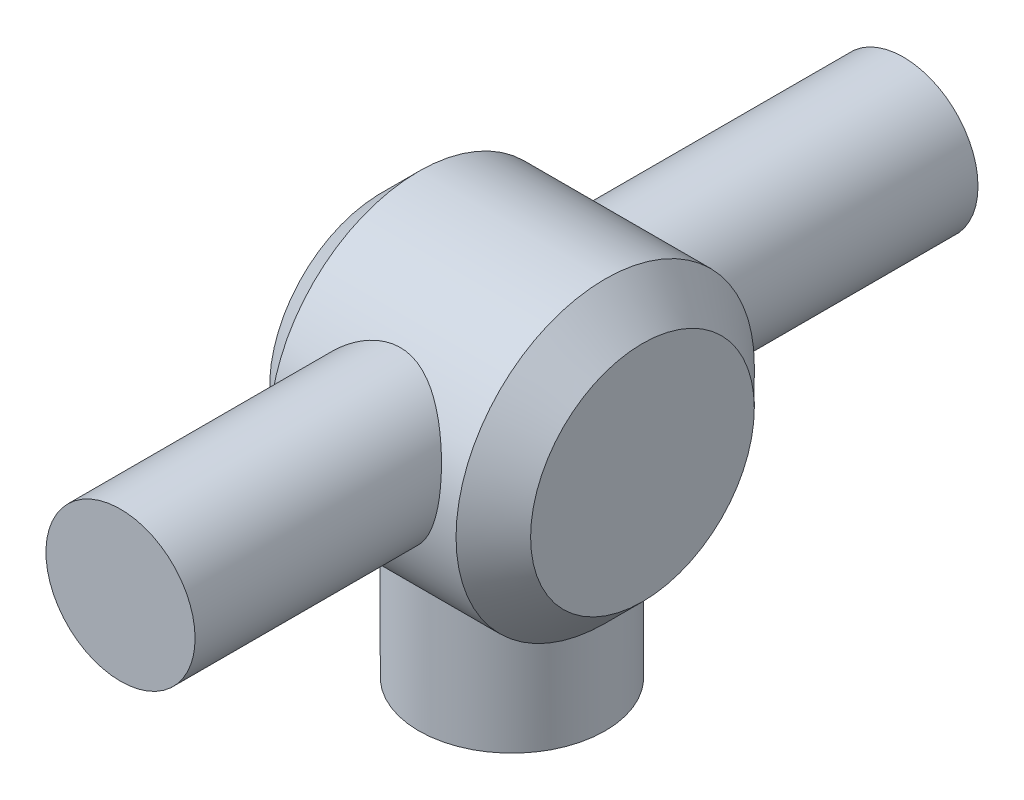
ISO-10303-21;
HEADER;
FILE_DESCRIPTION(('STEP AP214'),'2;1');
FILE_NAME('part.step','',(''),(''),'','','');
FILE_SCHEMA(('AUTOMOTIVE_DESIGN { 1 0 10303 214 1 1 1 1 }'));
ENDSEC;
DATA;
#1=APPLICATION_CONTEXT('core data for automotive mechanical design processes');
#2=APPLICATION_PROTOCOL_DEFINITION('international standard','automotive_design',2000,#1);
#3=PRODUCT_CONTEXT('',#1,'mechanical');
#4=PRODUCT('Part','Part','',(#3));
#5=PRODUCT_RELATED_PRODUCT_CATEGORY('part','',(#4));
#6=PRODUCT_DEFINITION_FORMATION('','',#4);
#7=PRODUCT_DEFINITION_CONTEXT('part definition',#1,'design');
#8=PRODUCT_DEFINITION('design','',#6,#7);
#9=PRODUCT_DEFINITION_SHAPE('','',#8);
#10=(LENGTH_UNIT() NAMED_UNIT(*) SI_UNIT(.MILLI.,.METRE.));
#11=(NAMED_UNIT(*) PLANE_ANGLE_UNIT() SI_UNIT($,.RADIAN.));
#12=(NAMED_UNIT(*) SI_UNIT($,.STERADIAN.) SOLID_ANGLE_UNIT());
#13=UNCERTAINTY_MEASURE_WITH_UNIT(LENGTH_MEASURE(1.E-05),#10,'distance_accuracy_value','');
#14=(GEOMETRIC_REPRESENTATION_CONTEXT(3) GLOBAL_UNCERTAINTY_ASSIGNED_CONTEXT((#13)) GLOBAL_UNIT_ASSIGNED_CONTEXT((#10,
#11,#12)) REPRESENTATION_CONTEXT('',''));
#15=CARTESIAN_POINT('',(0.,0.,0.));
#16=DIRECTION('',(0.,0.,1.));
#17=DIRECTION('',(1.,0.,0.));
#18=AXIS2_PLACEMENT_3D('',#15,#16,#17);
#19=CARTESIAN_POINT('',(7.,13.,0.));
#20=DIRECTION('',(-1.,0.,0.));
#21=DIRECTION('',(0.,0.,1.));
#22=AXIS2_PLACEMENT_3D('',#19,#20,#21);
#23=CYLINDRICAL_SURFACE('',#22,8.);
#24=CARTESIAN_POINT('',(-4.,14.3053691275168,-7.89278223701415));
#25=CARTESIAN_POINT('',(-4.00000119271462,14.4158728530555,-7.87450734536309));
#26=CARTESIAN_POINT('',(-3.99541687214258,14.52597476387,-7.85390753998862));
#27=CARTESIAN_POINT('',(-3.97732925303655,14.7445507478447,-7.80826545347509));
#28=CARTESIAN_POINT('',(-3.9638229157658,14.8530242535109,-7.78322166089102));
#29=CARTESIAN_POINT('',(-3.92820671519495,15.0676255697962,-7.72898337163268));
#30=CARTESIAN_POINT('',(-3.90608688498728,15.1737505119345,-7.69978409145749));
#31=CARTESIAN_POINT('',(-3.85365485074923,15.3828572679797,-7.63766437833316));
#32=CARTESIAN_POINT('',(-3.82333913459107,15.4858377132921,-7.60474235362799));
#33=CARTESIAN_POINT('',(-3.72116217929562,15.7878948173347,-7.50150546506693));
#34=CARTESIAN_POINT('',(-3.63781725883142,15.9815618484063,-7.42633907033986));
#35=CARTESIAN_POINT('',(-3.44391895731131,16.3506025048486,-7.26732264744268));
#36=CARTESIAN_POINT('',(-3.33336063095481,16.5259727970251,-7.18347104257642));
#37=CARTESIAN_POINT('',(-3.07507279060478,16.8735478130759,-7.0027002367167));
#38=CARTESIAN_POINT('',(-2.92467787094015,17.0435393237428,-6.90532753807903));
#39=CARTESIAN_POINT('',(-2.59671244175017,17.3563481808753,-6.71237747831019));
#40=CARTESIAN_POINT('',(-2.41913234581863,17.4991559014139,-6.6168007639043));
#41=CARTESIAN_POINT('',(-2.06239717285455,17.7385505403634,-6.44708659489637));
#42=CARTESIAN_POINT('',(-1.88619174652301,17.8386786329106,-6.37176146851123));
#43=CARTESIAN_POINT('',(-1.51600203651104,18.0125760357697,-6.235886264052));
#44=CARTESIAN_POINT('',(-1.32204839278194,18.0863897344876,-6.17531135983122));
#45=CARTESIAN_POINT('',(-0.956373755392185,18.1931330024981,-6.08566696845843));
#46=CARTESIAN_POINT('',(-0.787044259133036,18.231062328279,-6.05286738193358));
#47=CARTESIAN_POINT('',(-0.442379615399958,18.2846438004439,-6.00615100766975));
#48=CARTESIAN_POINT('',(-0.267050566183681,18.3003179175005,-5.99221559757018));
#49=CARTESIAN_POINT('',(0.0849751954343229,18.3083481125428,-5.98510485035391));
#50=CARTESIAN_POINT('',(0.261674098726634,18.3006515949661,-5.99197633902014));
#51=CARTESIAN_POINT('',(0.610650545683882,18.2623850556969,-6.0256048098014));
#52=CARTESIAN_POINT('',(0.782925300419447,18.2318009551147,-6.05237403158475));
#53=CARTESIAN_POINT('',(1.11561746181131,18.150394316434,-6.12177992204129));
#54=CARTESIAN_POINT('',(1.27619538133087,18.0999570973791,-6.16411353365601));
#55=CARTESIAN_POINT('',(1.58666997995037,17.9809887856591,-6.26064119860801));
#56=CARTESIAN_POINT('',(1.73655864818993,17.9124443001063,-6.31484402581372));
#57=CARTESIAN_POINT('',(2.09137036747583,17.7234404404702,-6.45823839068496));
#58=CARTESIAN_POINT('',(2.28955904782595,17.5936498968687,-6.55199505749772));
#59=CARTESIAN_POINT('',(2.56593244246961,17.3761642462476,-6.69752820096906));
#60=CARTESIAN_POINT('',(2.65466512305431,17.2997644401919,-6.74691734874261));
#61=CARTESIAN_POINT('',(2.82493962269178,17.1396899539733,-6.84630189947707));
#62=CARTESIAN_POINT('',(2.9064813556679,17.056015186752,-6.89629730968689));
#63=CARTESIAN_POINT('',(3.14114533446257,16.7930663766924,-7.04651931847217));
#64=CARTESIAN_POINT('',(3.28291323117886,16.60296467499,-7.14622283079917));
#65=CARTESIAN_POINT('',(3.46971627167675,16.2991676911616,-7.28890356226295));
#66=CARTESIAN_POINT('',(3.52768916912946,16.1947609031266,-7.33533079432511));
#67=CARTESIAN_POINT('',(3.63449324798705,15.9801242405465,-7.42511613325329));
#68=CARTESIAN_POINT('',(3.68332900922423,15.8698973189606,-7.46847577088393));
#69=CARTESIAN_POINT('',(3.77106041720657,15.6446450727974,-7.55117210633222));
#70=CARTESIAN_POINT('',(3.80999325151642,15.5296396447176,-7.59052351164417));
#71=CARTESIAN_POINT('',(3.8774982248931,15.2952519045508,-7.66465336541965));
#72=CARTESIAN_POINT('',(3.90607590269824,15.1758719700275,-7.6994342521857));
#73=CARTESIAN_POINT('',(3.95226101099922,14.9337128275963,-7.76379027566604));
#74=CARTESIAN_POINT('',(3.96987573737301,14.8109359373273,-7.79336886510066));
#75=CARTESIAN_POINT('',(3.99363097689962,14.5630590339328,-7.84684078623402));
#76=CARTESIAN_POINT('',(3.99977359799813,14.4379594518585,-7.87073516167626));
#77=CARTESIAN_POINT('',(4.00018346818961,14.2042730375005,-7.90959814449672));
#78=CARTESIAN_POINT('',(3.99598715118771,14.0958159816423,-7.9253467628291));
#79=CARTESIAN_POINT('',(3.97870195889283,13.8790499604502,-7.95230748809092));
#80=CARTESIAN_POINT('',(3.9656139741161,13.7707409813745,-7.96352004913512));
#81=CARTESIAN_POINT('',(3.93054791527892,13.5552298163698,-7.98144158314464));
#82=CARTESIAN_POINT('',(3.90857249552344,13.4480273097783,-7.98815189915255));
#83=CARTESIAN_POINT('',(3.85585327334973,13.2356166352547,-7.99723614607448));
#84=CARTESIAN_POINT('',(3.82510965248575,13.1304084260768,-7.99961016676824));
#85=CARTESIAN_POINT('',(3.75764938589171,12.9304612151275,-8.00027585350217));
#86=CARTESIAN_POINT('',(3.72153465291272,12.8355195773125,-7.99885361150921));
#87=CARTESIAN_POINT('',(3.64223254079553,12.6487297960589,-7.99283176880922));
#88=CARTESIAN_POINT('',(3.59904277120168,12.5568827108719,-7.98823109250253));
#89=CARTESIAN_POINT('',(3.45932551125048,12.2869462488901,-7.97019263634999));
#90=CARTESIAN_POINT('',(3.35259161303631,12.1142891447188,-7.95251779782195));
#91=CARTESIAN_POINT('',(3.10985589962906,11.7808524451646,-7.9084288317755));
#92=CARTESIAN_POINT('',(2.97280193267633,11.6208908916653,-7.88167483212062));
#93=CARTESIAN_POINT('',(2.67574171337111,11.3246947010479,-7.82407419950605));
#94=CARTESIAN_POINT('',(2.51572501579968,11.188470924483,-7.79322570453647));
#95=CARTESIAN_POINT('',(2.16421729811207,10.9339424871087,-7.72980262511336));
#96=CARTESIAN_POINT('',(1.97129888594756,10.8175940641435,-7.69726080168079));
#97=CARTESIAN_POINT('',(1.5679353931837,10.6186183723431,-7.63805279372964));
#98=CARTESIAN_POINT('',(1.35749191717186,10.535988020374,-7.61138607210246));
#99=CARTESIAN_POINT('',(0.925113241680595,10.407305154386,-7.56852551729576));
#100=CARTESIAN_POINT('',(0.703203954695296,10.3611737008225,-7.5523090964633));
#101=CARTESIAN_POINT('',(0.254256913356304,10.3070669166767,-7.53319195081146));
#102=CARTESIAN_POINT('',(0.0272213934960684,10.2990752719004,-7.53028553269805));
#103=CARTESIAN_POINT('',(-0.412400862361001,10.320931935051,-7.53808145341742));
#104=CARTESIAN_POINT('',(-0.625104989545556,10.3487572295059,-7.54805633035716));
#105=CARTESIAN_POINT('',(-1.04260837407777,10.4377409893942,-7.57872122367834));
#106=CARTESIAN_POINT('',(-1.24740633530111,10.4989048956661,-7.59941298902118));
#107=CARTESIAN_POINT('',(-1.64566245892642,10.653270711377,-7.64849172654819));
#108=CARTESIAN_POINT('',(-1.83900212292085,10.7467557029489,-7.67694620722072));
#109=CARTESIAN_POINT('',(-2.20792158065625,10.9630834384506,-7.73715512251023));
#110=CARTESIAN_POINT('',(-2.38349545903475,11.0859359152058,-7.76891064916742));
#111=CARTESIAN_POINT('',(-2.72209075077293,11.3658157092711,-7.83269123483723));
#112=CARTESIAN_POINT('',(-2.88389873182984,11.5243457701523,-7.8646358725558));
#113=CARTESIAN_POINT('',(-3.10512944196949,11.7812831999954,-7.9071050220433));
#114=CARTESIAN_POINT('',(-3.17533040548789,11.870181717527,-7.92036009612668));
#115=CARTESIAN_POINT('',(-3.30807289137335,12.0538218842306,-7.94438821482432));
#116=CARTESIAN_POINT('',(-3.37061788813174,12.1485608533481,-7.95516238727922));
#117=CARTESIAN_POINT('',(-3.48680755838168,12.342017437416,-7.97347997620663));
#118=CARTESIAN_POINT('',(-3.54055387163755,12.4406703792432,-7.98106215759977));
#119=CARTESIAN_POINT('',(-3.63960728270355,12.6422802116942,-7.99263561050786));
#120=CARTESIAN_POINT('',(-3.6849182492286,12.7452351026489,-7.99662853140333));
#121=CARTESIAN_POINT('',(-3.76667956194748,12.9545428154532,-8.00055455581634));
#122=CARTESIAN_POINT('',(-3.80314059915343,13.0608913600642,-8.0004925825294));
#123=CARTESIAN_POINT('',(-3.86695161269289,13.2761526628846,-7.99595706498474));
#124=CARTESIAN_POINT('',(-3.89430467018724,13.3850645405609,-7.99148501465515));
#125=CARTESIAN_POINT('',(-3.94471178579966,13.6286692882839,-7.97638647518776));
#126=CARTESIAN_POINT('',(-3.96550022539016,13.763768125964,-7.9646234953551));
#127=CARTESIAN_POINT('',(-3.99314304135283,14.0345679176035,-7.93399240275074));
#128=CARTESIAN_POINT('',(-3.99999854180382,14.1702688221041,-7.91512486330484));
#129=CARTESIAN_POINT('',(-4.,14.3053691275168,-7.89278223701415));
#130=B_SPLINE_CURVE_WITH_KNOTS('',3,(#24,#25,#26,#27,#28,#29,#30,#31,#32,#33,#34,#35,#36,#37,
#38,#39,#40,#41,#42,#43,#44,#45,#46,#47,#48,#49,#50,#51,#52,#53,#54,#55,#56,#57,#58,#59,#60,#61,
#62,#63,#64,#65,#66,#67,#68,#69,#70,#71,#72,#73,#74,#75,#76,#77,#78,#79,#80,#81,#82,#83,#84,#85,
#86,#87,#88,#89,#90,#91,#92,#93,#94,#95,#96,#97,#98,#99,#100,#101,#102,#103,#104,#105,#106,#107,
#108,#109,#110,#111,#112,#113,#114,#115,#116,#117,#118,#119,#120,#121,#122,#123,#124,#125,#126,
#127,#128,#129),.UNSPECIFIED.,.T.,.F.,(4,2,2,2,2,2,2,2,2,2,2,2,2,2,2,2,2,2,2,2,2,2,2,2,2,2,2,2,
2,2,2,2,2,2,2,2,2,2,2,2,2,2,2,2,2,2,2,2,2,2,2,2,4),(0.,0.335870598392049,0.671855649486722,
1.0082306388819,1.34475000189082,2.0132136616431,2.68179888638694,3.4197006034354,
4.15786313136421,4.80410782795651,5.44925719093807,5.97681190360082,6.50384544343996,
7.0320659495007,7.56061164837063,8.07936835622727,8.5985098376881,9.35853230946111,
9.7394518273144,10.1203759042081,10.8879469922157,11.2719603076136,11.6557806242542,
12.0381375973106,12.4202897533496,12.8021873132387,13.1840146943311,13.5126013365081,
13.8411550750021,14.169610760619,14.4980596457303,14.8024674638023,15.106978345647,
15.7154601253297,16.3498341275887,16.984497612132,17.6641758060423,18.3437918371779,
19.0219339508874,19.6997859652357,20.340979713959,20.9822781364076,21.6293419095603,
22.2766204273973,22.9593352272813,23.3011254077902,23.642759899218,23.9801165831915,
24.3173181615595,24.6541103387475,24.9907884656541,25.4014522825968,25.8120829667724),.UNSPECIFIED.);
#131=CARTESIAN_POINT('',(-4.,14.3053691275168,-7.89278223701415));
#132=VERTEX_POINT('',#131);
#133=EDGE_CURVE('E66',#132,#132,#130,.T.);
#134=ORIENTED_EDGE('',*,*,#133,.F.);
#135=EDGE_LOOP('',(#134));
#136=FACE_BOUND('',#135,.T.);
#137=CARTESIAN_POINT('',(0.,6.7550020016016,-5.));
#138=CARTESIAN_POINT('',(-0.124309997084916,6.75500000916682,-4.99999874728376));
#139=CARTESIAN_POINT('',(-0.248643911922182,6.75127405764847,-4.99535477639502));
#140=CARTESIAN_POINT('',(-0.49624234521784,6.73653766301122,-4.97686385741702));
#141=CARTESIAN_POINT('',(-0.619506190474288,6.72552292946121,-4.96301148892208));
#142=CARTESIAN_POINT('',(-0.864132894108489,6.69667182144299,-4.92631685582622));
#143=CARTESIAN_POINT('',(-0.985491401070756,6.67882168832019,-4.90345645667282));
#144=CARTESIAN_POINT('',(-1.22521846002732,6.63704499202719,-4.84912073775945));
#145=CARTESIAN_POINT('',(-1.34358548492504,6.61311539163948,-4.81764111134032));
#146=CARTESIAN_POINT('',(-1.69098285176996,6.53401289532329,-4.7115563432738));
#147=CARTESIAN_POINT('',(-1.91472159134201,6.47121155663097,-4.6249307188155));
#148=CARTESIAN_POINT('',(-2.34407629105235,6.33267691793246,-4.42286683667302));
#149=CARTESIAN_POINT('',(-2.54969175663766,6.25694326519119,-4.30742779304936));
#150=CARTESIAN_POINT('',(-2.9674414130167,6.08881997373091,-4.03296948836377));
#151=CARTESIAN_POINT('',(-3.17674952950574,5.99555887371068,-3.87018134056582));
#152=CARTESIAN_POINT('',(-3.56756025653039,5.80987475479006,-3.51319765959103));
#153=CARTESIAN_POINT('',(-3.74903864049325,5.71745253125593,-3.31897506071619));
#154=CARTESIAN_POINT('',(-4.00760626149244,5.58011028153599,-2.99356128179165));
#155=CARTESIAN_POINT('',(-4.09554829341698,5.53214809299076,-2.87212880091628));
#156=CARTESIAN_POINT('',(-4.2607595171728,5.44028123724694,-2.62078661715024));
#157=CARTESIAN_POINT('',(-4.33803318685166,5.39637487026874,-2.49088050482953));
#158=CARTESIAN_POINT('',(-4.48104536831486,5.31388521872264,-2.22333771815378));
#159=CARTESIAN_POINT('',(-4.54678952615798,5.27529933067984,-2.08570487145724));
#160=CARTESIAN_POINT('',(-4.66588913640084,5.20460246922697,-1.80358193532003));
#161=CARTESIAN_POINT('',(-4.71924684175159,5.17249031845973,-1.65909309867121));
#162=CARTESIAN_POINT('',(-4.8079574186921,5.11867120889423,-1.37943032429723));
#163=CARTESIAN_POINT('',(-4.84458864196752,5.09623864416181,-1.24480106420069));
#164=CARTESIAN_POINT('',(-4.90659427549434,5.05808155689148,-0.972050692903701));
#165=CARTESIAN_POINT('',(-4.93197055516711,5.04235592036422,-0.833930165626441));
#166=CARTESIAN_POINT('',(-4.97102838824165,5.01808987944357,-0.555534462309621));
#167=CARTESIAN_POINT('',(-4.98471957483722,5.0095435565138,-0.415261158337187));
#168=CARTESIAN_POINT('',(-5.00019508535282,4.99988044474153,-0.133810084943771));
#169=CARTESIAN_POINT('',(-5.00198077978344,4.99876280074055,0.00736757849820703));
#170=CARTESIAN_POINT('',(-4.99418306842006,5.00363455646968,0.270239609899374));
#171=CARTESIAN_POINT('',(-4.9860972278415,5.00868782415678,0.391999310072933));
#172=CARTESIAN_POINT('',(-4.96109950689231,5.02426101166964,0.634293592306139));
#173=CARTESIAN_POINT('',(-4.94418498400023,5.03478256821018,0.754827796543428));
#174=CARTESIAN_POINT('',(-4.90175195667388,5.06105212071524,0.993750416290299));
#175=CARTESIAN_POINT('',(-4.8762363638823,5.07679834799081,1.11213954368103));
#176=CARTESIAN_POINT('',(-4.81691536004192,5.11316716915434,1.34607315554106));
#177=CARTESIAN_POINT('',(-4.78310674467799,5.13379164782429,1.46161652141072));
#178=CARTESIAN_POINT('',(-4.66961406787293,5.20246162654745,1.80341623892686));
#179=CARTESIAN_POINT('',(-4.57793007291279,5.25726113043743,2.0244725048806));
#180=CARTESIAN_POINT('',(-4.36611560771666,5.3805790880367,2.44811588786114));
#181=CARTESIAN_POINT('',(-4.24597865675437,5.44910066667132,2.6506987826293));
#182=CARTESIAN_POINT('',(-3.96389668023518,5.60426585815475,3.05883635403528));
#183=CARTESIAN_POINT('',(-3.79860933546551,5.69210350605149,3.2616234577039));
#184=CARTESIAN_POINT('',(-3.43944259665051,5.87219783929323,3.63842034253163));
#185=CARTESIAN_POINT('',(-3.24552165003414,5.9644608129644,3.81238750882611));
#186=CARTESIAN_POINT('',(-2.92199806035766,6.10601221068418,4.05999923159469));
#187=CARTESIAN_POINT('',(-2.80103153254676,6.15656470961271,4.14440430037547));
#188=CARTESIAN_POINT('',(-2.5512511400869,6.2549500985773,4.30267035241461));
#189=CARTESIAN_POINT('',(-2.42243580756731,6.30278247664701,4.37652935467605));
#190=CARTESIAN_POINT('',(-2.15770926568204,6.39391985557554,4.51291782494085));
#191=CARTESIAN_POINT('',(-2.02181056536115,6.43723245747161,4.5754664481639));
#192=CARTESIAN_POINT('',(-1.74330768244433,6.51761076225732,4.6886516739402));
#193=CARTESIAN_POINT('',(-1.60070353986484,6.55467650242064,4.7392883475702));
#194=CARTESIAN_POINT('',(-1.34808415551627,6.61200889110861,4.81614194168603));
#195=CARTESIAN_POINT('',(-1.23937010533179,6.63412937255452,4.84527833481626));
#196=CARTESIAN_POINT('',(-1.01935900201234,6.6732799864158,4.89628944573215));
#197=CARTESIAN_POINT('',(-0.90806254138197,6.69031127428325,4.91816581196151));
#198=CARTESIAN_POINT('',(-0.683654493148009,6.7186775234786,4.95434333722363));
#199=CARTESIAN_POINT('',(-0.570545140796214,6.73001901487782,4.96865318123363));
#200=CARTESIAN_POINT('',(-0.343158274667138,6.74660867821763,4.98951663397229));
#201=CARTESIAN_POINT('',(-0.228880713516909,6.75185660205645,4.99606992689043));
#202=CARTESIAN_POINT('',(0.000213756327465791,6.75605436027393,5.00131530513999));
#203=CARTESIAN_POINT('',(0.11503129428545,6.7549908805862,4.99999077198392));
#204=CARTESIAN_POINT('',(0.344110589839955,6.74657676658025,4.98946310366481));
#205=CARTESIAN_POINT('',(0.458372127783271,6.73922382288687,4.98025707456075));
#206=CARTESIAN_POINT('',(0.685492435641882,6.71851058673522,4.95410620951326));
#207=CARTESIAN_POINT('',(0.798350719467859,6.70514826909445,4.9371587646522));
#208=CARTESIAN_POINT('',(1.02190368194708,6.67291344585554,4.8957794498311));
#209=CARTESIAN_POINT('',(1.13259744525952,6.6540386606847,4.87134448334739));
#210=CARTESIAN_POINT('',(1.45674114316006,6.59080260736446,4.78821642821575));
#211=CARTESIAN_POINT('',(1.6662777271024,6.53942279084502,4.71921780239627));
#212=CARTESIAN_POINT('',(2.07118631830434,6.42337515675119,4.55609149726001));
#213=CARTESIAN_POINT('',(2.26655326684989,6.3587026248171,4.46195489902188));
#214=CARTESIAN_POINT('',(2.67720575477837,6.20851493020262,4.23062377482239));
#215=CARTESIAN_POINT('',(2.88920195195314,6.12137580570542,4.08864375810928));
#216=CARTESIAN_POINT('',(3.28876845285956,5.94423083645791,3.77473221644168));
#217=CARTESIAN_POINT('',(3.47631305761312,5.85422209736,3.60276961587649));
#218=CARTESIAN_POINT('',(3.75109437385404,5.71555320809765,3.30924585333197));
#219=CARTESIAN_POINT('',(3.84742308399404,5.6653769098007,3.19677534649599));
#220=CARTESIAN_POINT('',(4.0302321149825,5.56785460683588,2.96297696798609));
#221=CARTESIAN_POINT('',(4.11671614194503,5.52050754029001,2.84165245789286));
#222=CARTESIAN_POINT('',(4.27912544276188,5.42990256618961,2.59064393379973));
#223=CARTESIAN_POINT('',(4.35504857193848,5.38664548978845,2.46095822963468));
#224=CARTESIAN_POINT('',(4.49544110368957,5.30547524823959,2.19402109584823));
#225=CARTESIAN_POINT('',(4.55991768393769,5.26755873734084,2.05677447863484));
#226=CARTESIAN_POINT('',(4.67313922374355,5.20023819954591,1.78389488579443));
#227=CARTESIAN_POINT('',(4.72258893611767,5.17046341143872,1.64864631402092));
#228=CARTESIAN_POINT('',(4.80988250173737,5.11750261089845,1.37327166975237));
#229=CARTESIAN_POINT('',(4.84773307297854,5.09431278515733,1.2331484731144));
#230=CARTESIAN_POINT('',(4.91121075887916,5.05523029039937,0.94928487154772));
#231=CARTESIAN_POINT('',(4.93684853590452,5.03933125661968,0.805547737630328));
#232=CARTESIAN_POINT('',(4.97547600812264,5.01531901792847,0.515747890604361));
#233=CARTESIAN_POINT('',(4.98846779564148,5.00720452503887,0.369685566273098));
#234=CARTESIAN_POINT('',(5.0005918204771,4.99963100163797,0.0984542398463504));
#235=CARTESIAN_POINT('',(5.00148999709849,4.999069140942,-0.0266091901107859));
#236=CARTESIAN_POINT('',(4.99391869226614,5.00380002672675,-0.2763844265485));
#237=CARTESIAN_POINT('',(4.98544635104715,5.00909456050611,-0.401096114033589));
#238=CARTESIAN_POINT('',(4.95925462589747,5.02540896984595,-0.649105048465704));
#239=CARTESIAN_POINT('',(4.94153930869471,5.03642632746688,-0.77240289311327));
#240=CARTESIAN_POINT('',(4.89709863543925,5.06392598473202,-1.01678782002796));
#241=CARTESIAN_POINT('',(4.87036980485838,5.08041039177331,-1.13787403075121));
#242=CARTESIAN_POINT('',(4.80933512611737,5.11779582284871,-1.37276960676339));
#243=CARTESIAN_POINT('',(4.7753290229642,5.13852100671375,-1.486685097437));
#244=CARTESIAN_POINT('',(4.69961071566991,5.1842827179715,-1.71105112688166));
#245=CARTESIAN_POINT('',(4.65789587685614,5.20932071918906,-1.82150046585626));
#246=CARTESIAN_POINT('',(4.52179700785277,5.29018291855305,-2.14674322952901));
#247=CARTESIAN_POINT('',(4.41641101660221,5.35178517024994,-2.3556119089249));
#248=CARTESIAN_POINT('',(4.16734603403121,5.49299198004063,-2.77466231937412));
#249=CARTESIAN_POINT('',(4.02082779517783,5.57380141892191,-2.98273013480178));
#250=CARTESIAN_POINT('',(3.6996977630728,5.7426528624279,-3.37285679634255));
#251=CARTESIAN_POINT('',(3.52505426989102,5.83070297254734,-3.55488585185797));
#252=CARTESIAN_POINT('',(3.12352869133323,6.01998385164808,-3.91489797533941));
#253=CARTESIAN_POINT('',(2.89274538552562,6.12128510713012,-4.08851588919804));
#254=CARTESIAN_POINT('',(2.40144255795418,6.31300717511665,-4.39509030747829));
#255=CARTESIAN_POINT('',(2.14093959230368,6.40343398839523,-4.52806930044201));
#256=CARTESIAN_POINT('',(1.65432760274299,6.54280849256901,-4.72397005512007));
#257=CARTESIAN_POINT('',(1.43325185965497,6.59650475458315,-4.79586701428079));
#258=CARTESIAN_POINT('',(1.09324362690463,6.66101243251272,-4.88041603953431));
#259=CARTESIAN_POINT('',(0.978627920072954,6.67983131157335,-4.90470355408435));
#260=CARTESIAN_POINT('',(0.747193668970047,6.71150261587877,-4.94524770814465));
#261=CARTESIAN_POINT('',(0.630376290428758,6.72435811108455,-4.9615084801139));
#262=CARTESIAN_POINT('',(0.427895086979104,6.74093410185866,-4.9823903295282));
#263=CARTESIAN_POINT('',(0.342553322442733,6.74619789972474,-4.98898701036639));
#264=CARTESIAN_POINT('',(0.171478227136943,6.75323297589921,-4.99779282932784));
#265=CARTESIAN_POINT('',(0.085744803327501,6.75500337591527,-5.00000086408101));
#266=CARTESIAN_POINT('',(0.,6.7550020016016,-5.));
#267=B_SPLINE_CURVE_WITH_KNOTS('',3,(#137,#138,#139,#140,#141,#142,#143,#144,#145,#146,#147,
#148,#149,#150,#151,#152,#153,#154,#155,#156,#157,#158,#159,#160,#161,#162,#163,#164,#165,#166,
#167,#168,#169,#170,#171,#172,#173,#174,#175,#176,#177,#178,#179,#180,#181,#182,#183,#184,#185,
#186,#187,#188,#189,#190,#191,#192,#193,#194,#195,#196,#197,#198,#199,#200,#201,#202,#203,#204,
#205,#206,#207,#208,#209,#210,#211,#212,#213,#214,#215,#216,#217,#218,#219,#220,#221,#222,#223,
#224,#225,#226,#227,#228,#229,#230,#231,#232,#233,#234,#235,#236,#237,#238,#239,#240,#241,#242,
#243,#244,#245,#246,#247,#248,#249,#250,#251,#252,#253,#254,#255,#256,#257,#258,#259,#260,#261,
#262,#263,#264,#265,#266),.UNSPECIFIED.,.T.,.F.,(4,2,2,2,2,2,2,2,2,2,2,2,2,2,2,2,2,2,2,2,2,2,2,
2,2,2,2,2,2,2,2,2,2,2,2,2,2,2,2,2,2,2,2,2,2,2,2,2,2,2,2,2,2,2,2,2,2,2,2,2,2,2,2,2,4),(0.,
0.372830631717394,0.745880919988992,1.11968608457865,1.49367836553752,2.2343739724708,
2.97508978546025,3.81517657771247,4.65599058786116,5.12769727095079,5.59920535801266,
6.0704818965238,6.54167264805615,6.9650003716167,7.38825775501684,7.8111658669397,
8.2340252946041,8.59998197802636,8.96604825916241,9.33199074341863,9.69807484639391,
10.4313641163756,11.1648205684642,11.9895533165928,12.8154948839412,13.2827866246025,
13.7501660272479,14.2167463086997,14.6833238060682,15.0271003394338,15.3707987622619,
15.7141018213498,16.0574188576537,16.4014603870609,16.7456282964257,17.0899122787371,
17.4343388350078,18.1111129623981,18.7881275281776,19.5940378131019,20.4007884080993,
20.8693475683427,21.337729748067,21.8062069071061,22.2743892571628,22.7148894158782,
23.1551339612148,23.5949934439159,24.0347801378503,24.409509228706,24.7843527137741,
25.1590314139736,25.5338547106938,25.8954875601863,26.2572442370256,26.9801965139639,
27.7781872367985,28.5770837508034,29.4911341692987,30.4046778558642,31.1173375632652,
31.472952845656,31.8283848529182,32.0854860972178,32.3426519723746),.UNSPECIFIED.);
#268=CARTESIAN_POINT('',(5.00000000000002,4.99999999999999,0.));
#269=VERTEX_POINT('',#268);
#270=CARTESIAN_POINT('',(-5.,5.,0.));
#271=VERTEX_POINT('',#270);
#272=EDGE_CURVE('E108',#269,#271,#267,.T.);
#273=ORIENTED_EDGE('',*,*,#272,.T.);
#274=CARTESIAN_POINT('',(-4.99999999999999,13.,0.));
#275=DIRECTION('',(1.,0.,0.));
#276=DIRECTION('',(0.,0.,-1.));
#277=AXIS2_PLACEMENT_3D('',#274,#275,#276);
#278=CIRCLE('',#277,8.);
#279=EDGE_CURVE('E49',#271,#271,#278,.T.);
#280=ORIENTED_EDGE('',*,*,#279,.T.);
#281=EDGE_CURVE('E113',#271,#269,#267,.T.);
#282=ORIENTED_EDGE('',*,*,#281,.T.);
#283=CARTESIAN_POINT('',(5.00000000000001,13.,0.));
#284=DIRECTION('',(1.,0.,0.));
#285=DIRECTION('',(0.,0.,-1.));
#286=AXIS2_PLACEMENT_3D('',#283,#284,#285);
#287=CIRCLE('',#286,8.);
#288=EDGE_CURVE('E45',#269,#269,#287,.F.);
#289=ORIENTED_EDGE('',*,*,#288,.T.);
#290=EDGE_LOOP('',(#273,#280,#282,#289));
#291=FACE_BOUND('',#290,.T.);
#292=CARTESIAN_POINT('',(3.78100667030965,13.,8.));
#293=CARTESIAN_POINT('',(3.84816950730598,13.1945715199202,7.99999080779558));
#294=CARTESIAN_POINT('',(3.90030997618639,13.3944790922089,7.99283664792614));
#295=CARTESIAN_POINT('',(3.9731270982663,13.798871171281,7.96259864041915));
#296=CARTESIAN_POINT('',(3.9937802269499,14.0033589843924,7.93950290135937));
#297=CARTESIAN_POINT('',(4.00379122074757,14.4102725477609,7.87739891175019));
#298=CARTESIAN_POINT('',(3.99320377162243,14.6127012796207,7.83841856976002));
#299=CARTESIAN_POINT('',(3.94248893476606,15.0103517918874,7.74598024630476));
#300=CARTESIAN_POINT('',(3.90235688098971,15.2055724287889,7.69251997883591));
#301=CARTESIAN_POINT('',(3.79332098985686,15.5907057861727,7.57167861482728));
#302=CARTESIAN_POINT('',(3.72351968199451,15.7802365041025,7.50389965272684));
#303=CARTESIAN_POINT('',(3.55812333920365,16.1437592014363,7.35901644445736));
#304=CARTESIAN_POINT('',(3.46252185820775,16.3177472830973,7.28190987048273));
#305=CARTESIAN_POINT('',(3.23424965709084,16.6695096227317,7.11179736357848));
#306=CARTESIAN_POINT('',(3.0983741277932,16.8448306779772,7.01802811705783));
#307=CARTESIAN_POINT('',(2.79966337442285,17.17082698273,6.8293265854255));
#308=CARTESIAN_POINT('',(2.6367804175609,17.3214576401353,6.73439252172531));
#309=CARTESIAN_POINT('',(2.36503791481982,17.5336194495484,6.5920095082472));
#310=CARTESIAN_POINT('',(2.26472509979704,17.6048060574528,6.54236457761609));
#311=CARTESIAN_POINT('',(2.05678177858316,17.7382853003293,6.44634759402441));
#312=CARTESIAN_POINT('',(1.9491496336484,17.8005759338166,6.39997627877003));
#313=CARTESIAN_POINT('',(1.72722023929577,17.9153931189914,6.31222043759025));
#314=CARTESIAN_POINT('',(1.61294032451224,17.9679436904808,6.27082373505869));
#315=CARTESIAN_POINT('',(1.37810432540055,18.0626093801438,6.19464878322384));
#316=CARTESIAN_POINT('',(1.25755234243281,18.1047312165023,6.15986627642738));
#317=CARTESIAN_POINT('',(0.970155730778118,18.1896967734227,6.08860383454636));
#318=CARTESIAN_POINT('',(0.801161426783556,18.2281926352155,6.05535078790506));
#319=CARTESIAN_POINT('',(0.457159551916742,18.2829651305229,6.0076323545622));
#320=CARTESIAN_POINT('',(0.282160188371804,18.2992709419628,5.9931422974314));
#321=CARTESIAN_POINT('',(-0.0694246603437373,18.3086382938592,5.9848484232451));
#322=CARTESIAN_POINT('',(-0.246013022830152,18.3016414324858,5.99109658076688));
#323=CARTESIAN_POINT('',(-0.594936239672047,18.2647743177463,6.02351361441055));
#324=CARTESIAN_POINT('',(-0.767268133968185,18.2348885848516,6.04969597177366));
#325=CARTESIAN_POINT('',(-1.10009053153504,18.1548586724035,6.11801355733545));
#326=CARTESIAN_POINT('',(-1.26074443469299,18.1051127297332,6.15983421887021));
#327=CARTESIAN_POINT('',(-1.57145627663982,17.9875129350896,6.25543489791806));
#328=CARTESIAN_POINT('',(-1.72150636917184,17.91964584824,6.30922365158693));
#329=CARTESIAN_POINT('',(-2.0766641749148,17.73237009882,6.45167205907287));
#330=CARTESIAN_POINT('',(-2.27508979320421,17.6036473221257,6.54494492968022));
#331=CARTESIAN_POINT('',(-2.55194046566451,17.3877940277933,6.68990754435624));
#332=CARTESIAN_POINT('',(-2.6408530250658,17.3119439225057,6.73913239762453));
#333=CARTESIAN_POINT('',(-2.81153275862906,17.152979951888,6.83824083146798));
#334=CARTESIAN_POINT('',(-2.89329985344728,17.0698660059202,6.8881244193507));
#335=CARTESIAN_POINT('',(-3.12876618767515,16.8085763902611,7.03811938952269));
#336=CARTESIAN_POINT('',(-3.27118025275097,16.6195844062053,7.13778930071558));
#337=CARTESIAN_POINT('',(-3.45914118648851,16.3174432237262,7.28059644226723));
#338=CARTESIAN_POINT('',(-3.5175319846754,16.2135862125559,7.3270956534918));
#339=CARTESIAN_POINT('',(-3.62524147778996,16.0000380083515,7.41708537088778));
#340=CARTESIAN_POINT('',(-3.67456466505158,15.8903497391904,7.46057736021682));
#341=CARTESIAN_POINT('',(-3.76350225800971,15.6657510482371,7.54374681772046));
#342=CARTESIAN_POINT('',(-3.80311925912908,15.5508420322302,7.58342530389295));
#343=CARTESIAN_POINT('',(-3.87199504622208,15.3165797207569,7.65823489081994));
#344=CARTESIAN_POINT('',(-3.90125934664839,15.1972288288514,7.69336840614557));
#345=CARTESIAN_POINT('',(-3.94881332367703,14.9550538070181,7.75844536828106));
#346=CARTESIAN_POINT('',(-3.96711029069523,14.8322320413115,7.78839225341052));
#347=CARTESIAN_POINT('',(-3.99221621659162,14.5841870150203,7.84260518230657));
#348=CARTESIAN_POINT('',(-3.99902730222964,14.4589642033643,7.86687227704317));
#349=CARTESIAN_POINT('',(-4.00065716974007,14.2249370432519,7.90642749380341));
#350=CARTESIAN_POINT('',(-3.99701270740251,14.11627255205,7.92249514255313));
#351=CARTESIAN_POINT('',(-3.98079790547593,13.8990349128213,7.95007666616953));
#352=CARTESIAN_POINT('',(-3.96822847674872,13.790461756605,7.96159100554995));
#353=CARTESIAN_POINT('',(-3.9341585851915,13.574371716178,7.98009113915139));
#354=CARTESIAN_POINT('',(-3.91266088138293,13.4668545161527,7.98707833064846));
#355=CARTESIAN_POINT('',(-3.86084997469665,13.253770258057,7.99668530420487));
#356=CARTESIAN_POINT('',(-3.83053697265045,13.1482031556176,7.99930518575181));
#357=CARTESIAN_POINT('',(-3.76391998711433,12.9477206724341,8.00040917877444));
#358=CARTESIAN_POINT('',(-3.72823607403159,12.852600343722,7.99918882004354));
#359=CARTESIAN_POINT('',(-3.64977694187685,12.6654167878642,7.99354992373042));
#360=CARTESIAN_POINT('',(-3.60699932887513,12.5733546053914,7.98913030478516));
#361=CARTESIAN_POINT('',(-3.46848633544543,12.3027250884975,7.97159839433948));
#362=CARTESIAN_POINT('',(-3.36251275648754,12.1295408458053,7.95421280171637));
#363=CARTESIAN_POINT('',(-3.12138112510921,11.7951334401569,7.91062496603608));
#364=CARTESIAN_POINT('',(-2.98519853344206,11.6346996408703,7.88408825749013));
#365=CARTESIAN_POINT('',(-2.68982870260377,11.337415920739,7.8267970085738));
#366=CARTESIAN_POINT('',(-2.53063106824211,11.20057671842,7.7960405625989));
#367=CARTESIAN_POINT('',(-2.18067590680151,10.9445750839322,7.73265009215433));
#368=CARTESIAN_POINT('',(-1.98847696142278,10.8273707947306,7.7000386970579));
#369=CARTESIAN_POINT('',(-1.58642487006375,10.6265471539164,7.64053293435406));
#370=CARTESIAN_POINT('',(-1.37657302005451,10.5429253394767,7.61363814757769));
#371=CARTESIAN_POINT('',(-0.944906549401448,10.4120482452204,7.57015941373279));
#372=CARTESIAN_POINT('',(-0.723101425160955,10.3647645390333,7.55356740901706));
#373=CARTESIAN_POINT('',(-0.274144686139155,10.3083733083556,7.53366360152558));
#374=CARTESIAN_POINT('',(-0.0469954454067328,10.2992491424299,7.5303460097849));
#375=CARTESIAN_POINT('',(0.393024731232828,10.3189669558084,7.53738135186527));
#376=CARTESIAN_POINT('',(0.606002237375263,10.3457778620722,7.54700304895947));
#377=CARTESIAN_POINT('',(1.02420488380261,10.4328198972136,7.57704927287167));
#378=CARTESIAN_POINT('',(1.22942910967708,10.4930549550255,7.59747506967424));
#379=CARTESIAN_POINT('',(1.62837798932472,10.6455389259293,7.64610489790363));
#380=CARTESIAN_POINT('',(1.82200382287272,10.7380267494113,7.67436664421556));
#381=CARTESIAN_POINT('',(2.19172676733345,10.9524537950679,7.73433356203146));
#382=CARTESIAN_POINT('',(2.36781281451532,11.0744114421258,7.76604088089672));
#383=CARTESIAN_POINT('',(2.70766679512452,11.3525052527513,7.82989235744836));
#384=CARTESIAN_POINT('',(2.87020395960167,11.510165719342,7.86196263581442));
#385=CARTESIAN_POINT('',(3.16673710373092,11.8512542010591,7.91897192438019));
#386=CARTESIAN_POINT('',(3.30077581845037,12.0346429397723,7.94392163179782));
#387=CARTESIAN_POINT('',(3.49227927599464,12.349807750115,7.97447079051744));
#388=CARTESIAN_POINT('',(3.55965210933827,12.4753012853967,7.98381682587148));
#389=CARTESIAN_POINT('',(3.68075463351637,12.7330098656258,7.99658457016492));
#390=CARTESIAN_POINT('',(3.73448452727927,12.8652248105621,8.00000636722729));
#391=CARTESIAN_POINT('',(3.78100667030965,13.,8.));
#392=B_SPLINE_CURVE_WITH_KNOTS('',3,(#292,#293,#294,#295,#296,#297,#298,#299,#300,#301,#302,
#303,#304,#305,#306,#307,#308,#309,#310,#311,#312,#313,#314,#315,#316,#317,#318,#319,#320,#321,
#322,#323,#324,#325,#326,#327,#328,#329,#330,#331,#332,#333,#334,#335,#336,#337,#338,#339,#340,
#341,#342,#343,#344,#345,#346,#347,#348,#349,#350,#351,#352,#353,#354,#355,#356,#357,#358,#359,
#360,#361,#362,#363,#364,#365,#366,#367,#368,#369,#370,#371,#372,#373,#374,#375,#376,#377,#378,
#379,#380,#381,#382,#383,#384,#385,#386,#387,#388,#389,#390,#391),.UNSPECIFIED.,.T.,.F.,(4,2,2,
2,2,2,2,2,2,2,2,2,2,2,2,2,2,2,2,2,2,2,2,2,2,2,2,2,2,2,2,2,2,2,2,2,2,2,2,2,2,2,2,2,2,2,2,2,2,4),
(0.,0.616984089420616,1.23442890850534,1.85079354918467,2.4672555545912,3.10386516374612,
3.74063397468748,4.46025961101234,5.18117093879066,5.5786599433272,5.97623823758666,
6.37282263179943,6.76915087792843,7.29625299228221,7.82266134277566,8.35038998484628,
8.87847584032991,9.39646543639123,9.91483438872335,10.6732556457397,11.0533744670141,
11.4334975086186,12.199678894379,12.5830027507875,12.9661361836199,13.3491670549289,
13.7319935933485,14.1145653689474,14.4970662986411,14.8263457136881,15.1555915280548,
15.4847356742788,15.8138723224763,16.1183163463526,16.4228633216331,17.0314137127172,
17.6650965965513,18.2990665949822,18.9782751466173,19.6574338782518,20.3360607790878,
21.0143916987913,21.6559550375163,22.2975938065582,22.9440901373604,23.590991715932,
24.27389217308,24.9557612441049,25.3831382030347,25.8105088046825),.UNSPECIFIED.);
#393=CARTESIAN_POINT('',(3.78100667030965,13.,8.));
#394=VERTEX_POINT('',#393);
#395=EDGE_CURVE('E56',#394,#394,#392,.T.);
#396=ORIENTED_EDGE('',*,*,#395,.F.);
#397=EDGE_LOOP('',(#396));
#398=FACE_BOUND('',#397,.T.);
#399=ADVANCED_FACE('F32',(#136,#291,#398),#23,.T.);
#400=CARTESIAN_POINT('',(0.,10.,0.));
#401=DIRECTION('',(0.,-1.,0.));
#402=DIRECTION('',(0.,0.,-1.));
#403=AXIS2_PLACEMENT_3D('',#400,#401,#402);
#404=CYLINDRICAL_SURFACE('',#403,5.);
#405=CARTESIAN_POINT('',(0.,0.,0.));
#406=DIRECTION('',(0.,1.,0.));
#407=DIRECTION('',(0.,0.,1.));
#408=AXIS2_PLACEMENT_3D('',#405,#406,#407);
#409=CIRCLE('',#408,5.);
#410=CARTESIAN_POINT('',(0.,0.,5.));
#411=VERTEX_POINT('',#410);
#412=EDGE_CURVE('E114',#411,#411,#409,.T.);
#413=ORIENTED_EDGE('',*,*,#412,.T.);
#414=EDGE_LOOP('',(#413));
#415=FACE_BOUND('',#414,.T.);
#416=ORIENTED_EDGE('',*,*,#281,.F.);
#417=ORIENTED_EDGE('',*,*,#272,.F.);
#418=EDGE_LOOP('',(#416,#417));
#419=FACE_BOUND('',#418,.T.);
#420=ADVANCED_FACE('F97',(#415,#419),#404,.T.);
#421=CARTESIAN_POINT('',(0.,0.,0.));
#422=DIRECTION('',(0.,1.,0.));
#423=DIRECTION('',(0.,0.,1.));
#424=AXIS2_PLACEMENT_3D('',#421,#422,#423);
#425=PLANE('',#424);
#426=ORIENTED_EDGE('',*,*,#412,.F.);
#427=EDGE_LOOP('',(#426));
#428=FACE_BOUND('',#427,.T.);
#429=ADVANCED_FACE('F88',(#428),#425,.F.);
#430=CARTESIAN_POINT('',(7.,13.,0.));
#431=DIRECTION('',(1.,0.,0.));
#432=DIRECTION('',(0.,0.,-1.));
#433=AXIS2_PLACEMENT_3D('',#430,#431,#432);
#434=PLANE('',#433);
#435=CARTESIAN_POINT('',(7.,13.,0.));
#436=DIRECTION('',(1.,0.,0.));
#437=DIRECTION('',(0.,0.,-1.));
#438=AXIS2_PLACEMENT_3D('',#435,#436,#437);
#439=CIRCLE('',#438,5.99999999999999);
#440=CARTESIAN_POINT('',(7.,13.,-5.99999999999999));
#441=VERTEX_POINT('',#440);
#442=EDGE_CURVE('E11',#441,#441,#439,.T.);
#443=ORIENTED_EDGE('',*,*,#442,.T.);
#444=EDGE_LOOP('',(#443));
#445=FACE_BOUND('',#444,.T.);
#446=ADVANCED_FACE('F84',(#445),#434,.T.);
#447=CARTESIAN_POINT('',(-7.,13.,0.));
#448=DIRECTION('',(1.,0.,0.));
#449=DIRECTION('',(0.,0.,-1.));
#450=AXIS2_PLACEMENT_3D('',#447,#448,#449);
#451=PLANE('',#450);
#452=CARTESIAN_POINT('',(-7.,13.,0.));
#453=DIRECTION('',(1.,0.,0.));
#454=DIRECTION('',(0.,0.,-1.));
#455=AXIS2_PLACEMENT_3D('',#452,#453,#454);
#456=CIRCLE('',#455,6.);
#457=CARTESIAN_POINT('',(-7.,13.,-6.));
#458=VERTEX_POINT('',#457);
#459=EDGE_CURVE('E40',#458,#458,#456,.F.);
#460=ORIENTED_EDGE('',*,*,#459,.T.);
#461=EDGE_LOOP('',(#460));
#462=FACE_BOUND('',#461,.T.);
#463=ADVANCED_FACE('F87',(#462),#451,.F.);
#464=CARTESIAN_POINT('',(0.,14.3053691275168,-21.));
#465=DIRECTION('',(0.,0.,1.));
#466=DIRECTION('',(1.,0.,0.));
#467=AXIS2_PLACEMENT_3D('',#464,#465,#466);
#468=PLANE('',#467);
#469=CARTESIAN_POINT('',(0.,14.3053691275168,-21.));
#470=DIRECTION('',(0.,0.,1.));
#471=DIRECTION('',(1.,0.,0.));
#472=AXIS2_PLACEMENT_3D('',#469,#470,#471);
#473=CIRCLE('',#472,4.);
#474=CARTESIAN_POINT('',(4.,14.3053691275168,-21.));
#475=VERTEX_POINT('',#474);
#476=EDGE_CURVE('E134',#475,#475,#473,.T.);
#477=ORIENTED_EDGE('',*,*,#476,.F.);
#478=EDGE_LOOP('',(#477));
#479=FACE_BOUND('',#478,.T.);
#480=ADVANCED_FACE('F82',(#479),#468,.F.);
#481=CARTESIAN_POINT('',(0.,14.3053691275168,21.));
#482=DIRECTION('',(0.,0.,-1.));
#483=DIRECTION('',(-1.,0.,0.));
#484=AXIS2_PLACEMENT_3D('',#481,#482,#483);
#485=CYLINDRICAL_SURFACE('',#484,4.);
#486=ORIENTED_EDGE('',*,*,#476,.T.);
#487=EDGE_LOOP('',(#486));
#488=FACE_BOUND('',#487,.T.);
#489=ORIENTED_EDGE('',*,*,#133,.T.);
#490=EDGE_LOOP('',(#489));
#491=FACE_BOUND('',#490,.T.);
#492=ADVANCED_FACE('F80',(#488,#491),#485,.T.);
#493=CARTESIAN_POINT('',(0.,14.3053691275168,21.));
#494=DIRECTION('',(0.,0.,1.));
#495=DIRECTION('',(1.,0.,0.));
#496=AXIS2_PLACEMENT_3D('',#493,#494,#495);
#497=CIRCLE('',#496,4.);
#498=CARTESIAN_POINT('',(4.,14.3053691275168,21.));
#499=VERTEX_POINT('',#498);
#500=EDGE_CURVE('E133',#499,#499,#497,.T.);
#501=ORIENTED_EDGE('',*,*,#500,.F.);
#502=EDGE_LOOP('',(#501));
#503=FACE_BOUND('',#502,.T.);
#504=ORIENTED_EDGE('',*,*,#395,.T.);
#505=EDGE_LOOP('',(#504));
#506=FACE_BOUND('',#505,.T.);
#507=ADVANCED_FACE('F74',(#503,#506),#485,.T.);
#508=CARTESIAN_POINT('',(0.,14.3053691275168,21.));
#509=DIRECTION('',(0.,0.,1.));
#510=DIRECTION('',(1.,0.,0.));
#511=AXIS2_PLACEMENT_3D('',#508,#509,#510);
#512=PLANE('',#511);
#513=ORIENTED_EDGE('',*,*,#500,.T.);
#514=EDGE_LOOP('',(#513));
#515=FACE_BOUND('',#514,.T.);
#516=ADVANCED_FACE('F79',(#515),#512,.T.);
#517=CARTESIAN_POINT('',(-4.99999999999999,13.,0.));
#518=DIRECTION('',(1.,0.,0.));
#519=DIRECTION('',(0.,0.,-1.));
#520=AXIS2_PLACEMENT_3D('',#517,#518,#519);
#521=CONICAL_SURFACE('',#520,8.,0.785398163397447);
#522=ORIENTED_EDGE('',*,*,#459,.F.);
#523=EDGE_LOOP('',(#522));
#524=FACE_BOUND('',#523,.T.);
#525=ORIENTED_EDGE('',*,*,#279,.F.);
#526=EDGE_LOOP('',(#525));
#527=FACE_BOUND('',#526,.T.);
#528=ADVANCED_FACE('F50',(#524,#527),#521,.T.);
#529=CARTESIAN_POINT('',(7.,13.,0.));
#530=DIRECTION('',(-1.,0.,0.));
#531=DIRECTION('',(0.,0.,1.));
#532=AXIS2_PLACEMENT_3D('',#529,#530,#531);
#533=CONICAL_SURFACE('',#532,5.99999999999999,0.785398163397451);
#534=ORIENTED_EDGE('',*,*,#288,.F.);
#535=EDGE_LOOP('',(#534));
#536=FACE_BOUND('',#535,.T.);
#537=ORIENTED_EDGE('',*,*,#442,.F.);
#538=EDGE_LOOP('',(#537));
#539=FACE_BOUND('',#538,.T.);
#540=ADVANCED_FACE('F34',(#536,#539),#533,.T.);
#541=CLOSED_SHELL('',(#399,#420,#429,#446,#463,#480,#492,#507,#516,#528,#540));
#542=MANIFOLD_SOLID_BREP('B2',#541);
#543=ADVANCED_BREP_SHAPE_REPRESENTATION('',(#18,#542),#14);
#544=SHAPE_DEFINITION_REPRESENTATION(#9,#543);
ENDSEC;
END-ISO-10303-21;
